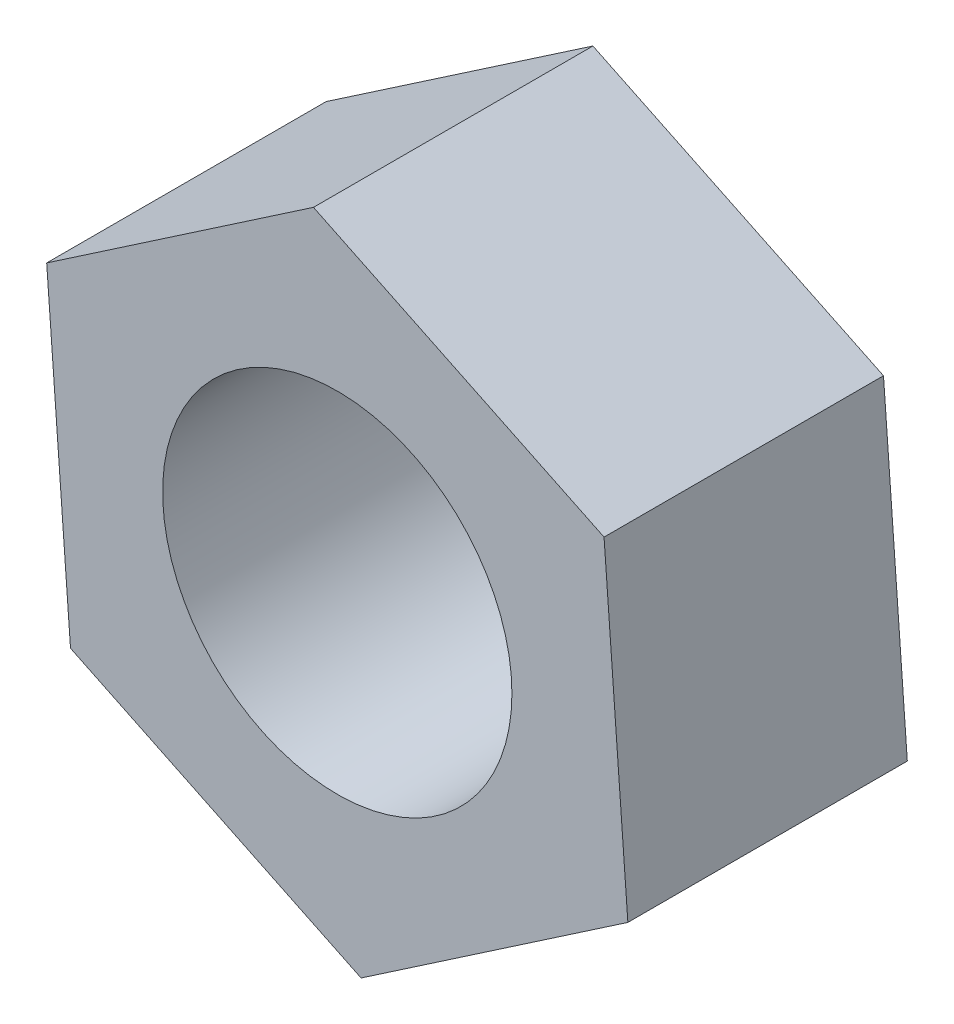
ISO-10303-21;
HEADER;
FILE_DESCRIPTION(('STEP AP214'),'2;1');
FILE_NAME('part.step','',(''),(''),'','','');
FILE_SCHEMA(('AUTOMOTIVE_DESIGN { 1 0 10303 214 1 1 1 1 }'));
ENDSEC;
DATA;
#1=APPLICATION_CONTEXT('core data for automotive mechanical design processes');
#2=APPLICATION_PROTOCOL_DEFINITION('international standard','automotive_design',2000,#1);
#3=PRODUCT_CONTEXT('',#1,'mechanical');
#4=PRODUCT('Part','Part','',(#3));
#5=PRODUCT_RELATED_PRODUCT_CATEGORY('part','',(#4));
#6=PRODUCT_DEFINITION_FORMATION('','',#4);
#7=PRODUCT_DEFINITION_CONTEXT('part definition',#1,'design');
#8=PRODUCT_DEFINITION('design','',#6,#7);
#9=PRODUCT_DEFINITION_SHAPE('','',#8);
#10=(LENGTH_UNIT() NAMED_UNIT(*) SI_UNIT(.MILLI.,.METRE.));
#11=(NAMED_UNIT(*) PLANE_ANGLE_UNIT() SI_UNIT($,.RADIAN.));
#12=(NAMED_UNIT(*) SI_UNIT($,.STERADIAN.) SOLID_ANGLE_UNIT());
#13=UNCERTAINTY_MEASURE_WITH_UNIT(LENGTH_MEASURE(1.E-05),#10,'distance_accuracy_value','');
#14=(GEOMETRIC_REPRESENTATION_CONTEXT(3) GLOBAL_UNCERTAINTY_ASSIGNED_CONTEXT((#13)) GLOBAL_UNIT_ASSIGNED_CONTEXT((#10,
#11,#12)) REPRESENTATION_CONTEXT('',''));
#15=CARTESIAN_POINT('',(0.,0.,0.));
#16=DIRECTION('',(0.,0.,1.));
#17=DIRECTION('',(1.,0.,0.));
#18=AXIS2_PLACEMENT_3D('',#15,#16,#17);
#19=CARTESIAN_POINT('',(0.,0.,4.));
#20=DIRECTION('',(0.,0.,1.));
#21=DIRECTION('',(1.,0.,0.));
#22=AXIS2_PLACEMENT_3D('',#19,#20,#21);
#23=PLANE('',#22);
#24=DIRECTION('',(0.0738190941873397,-0.997271648716317,0.));
#25=VECTOR('',#24,1.);
#26=CARTESIAN_POINT('',(-4.15956449046685,2.00782384261683,4.));
#27=LINE('',#26,#25);
#28=CARTESIAN_POINT('',(-4.15956449046685,2.00782384261683,4.));
#29=VERTEX_POINT('',#28);
#30=CARTESIAN_POINT('',(-3.81860869926369,-2.59837659611555,4.));
#31=VERTEX_POINT('',#30);
#32=EDGE_CURVE('E130',#29,#31,#27,.T.);
#33=ORIENTED_EDGE('',*,*,#32,.T.);
#34=DIRECTION('',(0.900572129355991,-0.434706613507566,0.));
#35=VECTOR('',#34,1.);
#36=CARTESIAN_POINT('',(-3.81860869926369,-2.59837659611555,4.));
#37=LINE('',#36,#35);
#38=CARTESIAN_POINT('',(0.340955791203159,-4.60620043873238,4.));
#39=VERTEX_POINT('',#38);
#40=EDGE_CURVE('E88',#31,#39,#37,.T.);
#41=ORIENTED_EDGE('',*,*,#40,.T.);
#42=DIRECTION('',(0.826753035168651,0.562565035208751,0.));
#43=VECTOR('',#42,1.);
#44=CARTESIAN_POINT('',(0.340955791203159,-4.60620043873238,4.));
#45=LINE('',#44,#43);
#46=CARTESIAN_POINT('',(4.15956449046685,-2.00782384261683,4.));
#47=VERTEX_POINT('',#46);
#48=EDGE_CURVE('E101',#39,#47,#45,.T.);
#49=ORIENTED_EDGE('',*,*,#48,.T.);
#50=DIRECTION('',(-0.07381909418734,0.997271648716317,0.));
#51=VECTOR('',#50,1.);
#52=CARTESIAN_POINT('',(4.15956449046685,-2.00782384261683,4.));
#53=LINE('',#52,#51);
#54=CARTESIAN_POINT('',(3.81860869926369,2.59837659611555,4.));
#55=VERTEX_POINT('',#54);
#56=EDGE_CURVE('E95',#47,#55,#53,.T.);
#57=ORIENTED_EDGE('',*,*,#56,.T.);
#58=DIRECTION('',(-0.900572129355991,0.434706613507566,0.));
#59=VECTOR('',#58,1.);
#60=CARTESIAN_POINT('',(3.81860869926369,2.59837659611555,4.));
#61=LINE('',#60,#59);
#62=CARTESIAN_POINT('',(-0.340955791203159,4.60620043873238,4.));
#63=VERTEX_POINT('',#62);
#64=EDGE_CURVE('E99',#55,#63,#61,.T.);
#65=ORIENTED_EDGE('',*,*,#64,.T.);
#66=DIRECTION('',(-0.826753035168651,-0.562565035208751,0.));
#67=VECTOR('',#66,1.);
#68=CARTESIAN_POINT('',(-0.340955791203159,4.60620043873238,4.));
#69=LINE('',#68,#67);
#70=EDGE_CURVE('E51',#63,#29,#69,.T.);
#71=ORIENTED_EDGE('',*,*,#70,.T.);
#72=EDGE_LOOP('',(#33,#41,#49,#57,#65,#71));
#73=FACE_BOUND('',#72,.T.);
#74=CARTESIAN_POINT('',(0.,0.,4.));
#75=DIRECTION('',(0.,0.,1.));
#76=DIRECTION('',(1.,0.,0.));
#77=AXIS2_PLACEMENT_3D('',#74,#75,#76);
#78=CIRCLE('',#77,2.5);
#79=CARTESIAN_POINT('',(2.5,0.,4.));
#80=VERTEX_POINT('',#79);
#81=EDGE_CURVE('E123',#80,#80,#78,.T.);
#82=ORIENTED_EDGE('',*,*,#81,.F.);
#83=EDGE_LOOP('',(#82));
#84=FACE_BOUND('',#83,.T.);
#85=ADVANCED_FACE('F34',(#73,#84),#23,.T.);
#86=CARTESIAN_POINT('',(0.,0.,0.));
#87=DIRECTION('',(0.,0.,1.));
#88=DIRECTION('',(1.,0.,0.));
#89=AXIS2_PLACEMENT_3D('',#86,#87,#88);
#90=PLANE('',#89);
#91=DIRECTION('',(0.0738190941873397,-0.997271648716317,0.));
#92=VECTOR('',#91,1.);
#93=CARTESIAN_POINT('',(-4.15956449046685,2.00782384261683,0.));
#94=LINE('',#93,#92);
#95=CARTESIAN_POINT('',(-4.15956449046685,2.00782384261683,0.));
#96=VERTEX_POINT('',#95);
#97=CARTESIAN_POINT('',(-3.81860869926369,-2.59837659611555,0.));
#98=VERTEX_POINT('',#97);
#99=EDGE_CURVE('E119',#96,#98,#94,.T.);
#100=ORIENTED_EDGE('',*,*,#99,.F.);
#101=DIRECTION('',(-0.826753035168651,-0.562565035208751,0.));
#102=VECTOR('',#101,1.);
#103=CARTESIAN_POINT('',(-0.340955791203159,4.60620043873238,0.));
#104=LINE('',#103,#102);
#105=CARTESIAN_POINT('',(-0.340955791203159,4.60620043873238,0.));
#106=VERTEX_POINT('',#105);
#107=EDGE_CURVE('E80',#106,#96,#104,.T.);
#108=ORIENTED_EDGE('',*,*,#107,.F.);
#109=DIRECTION('',(-0.900572129355991,0.434706613507566,0.));
#110=VECTOR('',#109,1.);
#111=CARTESIAN_POINT('',(3.81860869926369,2.59837659611555,0.));
#112=LINE('',#111,#110);
#113=CARTESIAN_POINT('',(3.81860869926369,2.59837659611555,0.));
#114=VERTEX_POINT('',#113);
#115=EDGE_CURVE('E74',#114,#106,#112,.T.);
#116=ORIENTED_EDGE('',*,*,#115,.F.);
#117=DIRECTION('',(-0.07381909418734,0.997271648716317,0.));
#118=VECTOR('',#117,1.);
#119=CARTESIAN_POINT('',(4.15956449046685,-2.00782384261683,0.));
#120=LINE('',#119,#118);
#121=CARTESIAN_POINT('',(4.15956449046685,-2.00782384261683,0.));
#122=VERTEX_POINT('',#121);
#123=EDGE_CURVE('E109',#122,#114,#120,.T.);
#124=ORIENTED_EDGE('',*,*,#123,.F.);
#125=DIRECTION('',(0.826753035168651,0.562565035208751,0.));
#126=VECTOR('',#125,1.);
#127=CARTESIAN_POINT('',(0.340955791203159,-4.60620043873238,0.));
#128=LINE('',#127,#126);
#129=CARTESIAN_POINT('',(0.340955791203159,-4.60620043873238,0.));
#130=VERTEX_POINT('',#129);
#131=EDGE_CURVE('E125',#130,#122,#128,.T.);
#132=ORIENTED_EDGE('',*,*,#131,.F.);
#133=DIRECTION('',(0.900572129355991,-0.434706613507566,0.));
#134=VECTOR('',#133,1.);
#135=CARTESIAN_POINT('',(-3.81860869926369,-2.59837659611555,0.));
#136=LINE('',#135,#134);
#137=EDGE_CURVE('E122',#98,#130,#136,.T.);
#138=ORIENTED_EDGE('',*,*,#137,.F.);
#139=EDGE_LOOP('',(#100,#108,#116,#124,#132,#138));
#140=FACE_BOUND('',#139,.T.);
#141=CARTESIAN_POINT('',(0.,0.,0.));
#142=DIRECTION('',(0.,0.,1.));
#143=DIRECTION('',(1.,0.,0.));
#144=AXIS2_PLACEMENT_3D('',#141,#142,#143);
#145=CIRCLE('',#144,2.5);
#146=CARTESIAN_POINT('',(2.5,0.,0.));
#147=VERTEX_POINT('',#146);
#148=EDGE_CURVE('E223',#147,#147,#145,.T.);
#149=ORIENTED_EDGE('',*,*,#148,.T.);
#150=EDGE_LOOP('',(#149));
#151=FACE_BOUND('',#150,.T.);
#152=ADVANCED_FACE('F139',(#140,#151),#90,.F.);
#153=CARTESIAN_POINT('',(-4.15956449046685,2.00782384261683,4.));
#154=DIRECTION('',(0.997271648716317,0.0738190941873397,0.));
#155=DIRECTION('',(-0.0738190941873397,0.997271648716317,0.));
#156=AXIS2_PLACEMENT_3D('',#153,#154,#155);
#157=PLANE('',#156);
#158=ORIENTED_EDGE('',*,*,#99,.T.);
#159=DIRECTION('',(0.,0.,-1.));
#160=VECTOR('',#159,1.);
#161=CARTESIAN_POINT('',(-3.81860869926369,-2.59837659611555,4.));
#162=LINE('',#161,#160);
#163=EDGE_CURVE('E11',#31,#98,#162,.T.);
#164=ORIENTED_EDGE('',*,*,#163,.F.);
#165=ORIENTED_EDGE('',*,*,#32,.F.);
#166=DIRECTION('',(0.,0.,-1.));
#167=VECTOR('',#166,1.);
#168=CARTESIAN_POINT('',(-4.15956449046685,2.00782384261683,4.));
#169=LINE('',#168,#167);
#170=EDGE_CURVE('E115',#29,#96,#169,.T.);
#171=ORIENTED_EDGE('',*,*,#170,.T.);
#172=EDGE_LOOP('',(#158,#164,#165,#171));
#173=FACE_BOUND('',#172,.T.);
#174=ADVANCED_FACE('F36',(#173),#157,.F.);
#175=CARTESIAN_POINT('',(-3.81860869926369,-2.59837659611555,4.));
#176=DIRECTION('',(0.434706613507566,0.900572129355991,0.));
#177=DIRECTION('',(-0.900572129355991,0.434706613507566,0.));
#178=AXIS2_PLACEMENT_3D('',#175,#176,#177);
#179=PLANE('',#178);
#180=ORIENTED_EDGE('',*,*,#137,.T.);
#181=DIRECTION('',(0.,0.,-1.));
#182=VECTOR('',#181,1.);
#183=CARTESIAN_POINT('',(0.340955791203159,-4.60620043873238,4.));
#184=LINE('',#183,#182);
#185=EDGE_CURVE('E43',#39,#130,#184,.T.);
#186=ORIENTED_EDGE('',*,*,#185,.F.);
#187=ORIENTED_EDGE('',*,*,#40,.F.);
#188=ORIENTED_EDGE('',*,*,#163,.T.);
#189=EDGE_LOOP('',(#180,#186,#187,#188));
#190=FACE_BOUND('',#189,.T.);
#191=ADVANCED_FACE('F164',(#190),#179,.F.);
#192=CARTESIAN_POINT('',(0.340955791203159,-4.60620043873238,4.));
#193=DIRECTION('',(-0.562565035208751,0.826753035168651,0.));
#194=DIRECTION('',(-0.826753035168651,-0.562565035208751,0.));
#195=AXIS2_PLACEMENT_3D('',#192,#193,#194);
#196=PLANE('',#195);
#197=ORIENTED_EDGE('',*,*,#131,.T.);
#198=DIRECTION('',(0.,0.,-1.));
#199=VECTOR('',#198,1.);
#200=CARTESIAN_POINT('',(4.15956449046685,-2.00782384261683,4.));
#201=LINE('',#200,#199);
#202=EDGE_CURVE('E110',#47,#122,#201,.T.);
#203=ORIENTED_EDGE('',*,*,#202,.F.);
#204=ORIENTED_EDGE('',*,*,#48,.F.);
#205=ORIENTED_EDGE('',*,*,#185,.T.);
#206=EDGE_LOOP('',(#197,#203,#204,#205));
#207=FACE_BOUND('',#206,.T.);
#208=ADVANCED_FACE('F136',(#207),#196,.F.);
#209=CARTESIAN_POINT('',(4.15956449046685,-2.00782384261683,4.));
#210=DIRECTION('',(-0.997271648716317,-0.07381909418734,0.));
#211=DIRECTION('',(0.07381909418734,-0.997271648716317,0.));
#212=AXIS2_PLACEMENT_3D('',#209,#210,#211);
#213=PLANE('',#212);
#214=ORIENTED_EDGE('',*,*,#123,.T.);
#215=DIRECTION('',(0.,0.,-1.));
#216=VECTOR('',#215,1.);
#217=CARTESIAN_POINT('',(3.81860869926369,2.59837659611555,4.));
#218=LINE('',#217,#216);
#219=EDGE_CURVE('E106',#55,#114,#218,.T.);
#220=ORIENTED_EDGE('',*,*,#219,.F.);
#221=ORIENTED_EDGE('',*,*,#56,.F.);
#222=ORIENTED_EDGE('',*,*,#202,.T.);
#223=EDGE_LOOP('',(#214,#220,#221,#222));
#224=FACE_BOUND('',#223,.T.);
#225=ADVANCED_FACE('F107',(#224),#213,.F.);
#226=CARTESIAN_POINT('',(3.81860869926369,2.59837659611555,4.));
#227=DIRECTION('',(-0.434706613507566,-0.900572129355991,0.));
#228=DIRECTION('',(0.900572129355991,-0.434706613507566,0.));
#229=AXIS2_PLACEMENT_3D('',#226,#227,#228);
#230=PLANE('',#229);
#231=ORIENTED_EDGE('',*,*,#115,.T.);
#232=DIRECTION('',(0.,0.,-1.));
#233=VECTOR('',#232,1.);
#234=CARTESIAN_POINT('',(-0.340955791203159,4.60620043873238,4.));
#235=LINE('',#234,#233);
#236=EDGE_CURVE('E111',#63,#106,#235,.T.);
#237=ORIENTED_EDGE('',*,*,#236,.F.);
#238=ORIENTED_EDGE('',*,*,#64,.F.);
#239=ORIENTED_EDGE('',*,*,#219,.T.);
#240=EDGE_LOOP('',(#231,#237,#238,#239));
#241=FACE_BOUND('',#240,.T.);
#242=ADVANCED_FACE('F113',(#241),#230,.F.);
#243=CARTESIAN_POINT('',(-0.340955791203159,4.60620043873238,4.));
#244=DIRECTION('',(0.562565035208751,-0.826753035168651,0.));
#245=DIRECTION('',(0.826753035168651,0.562565035208751,0.));
#246=AXIS2_PLACEMENT_3D('',#243,#244,#245);
#247=PLANE('',#246);
#248=ORIENTED_EDGE('',*,*,#107,.T.);
#249=ORIENTED_EDGE('',*,*,#170,.F.);
#250=ORIENTED_EDGE('',*,*,#70,.F.);
#251=ORIENTED_EDGE('',*,*,#236,.T.);
#252=EDGE_LOOP('',(#248,#249,#250,#251));
#253=FACE_BOUND('',#252,.T.);
#254=ADVANCED_FACE('F144',(#253),#247,.F.);
#255=CARTESIAN_POINT('',(0.,0.,4.));
#256=DIRECTION('',(0.,0.,-1.));
#257=DIRECTION('',(-1.,0.,0.));
#258=AXIS2_PLACEMENT_3D('',#255,#256,#257);
#259=CYLINDRICAL_SURFACE('',#258,2.5);
#260=ORIENTED_EDGE('',*,*,#81,.T.);
#261=EDGE_LOOP('',(#260));
#262=FACE_BOUND('',#261,.T.);
#263=ORIENTED_EDGE('',*,*,#148,.F.);
#264=EDGE_LOOP('',(#263));
#265=FACE_BOUND('',#264,.T.);
#266=ADVANCED_FACE('F146',(#262,#265),#259,.F.);
#267=CLOSED_SHELL('',(#85,#152,#174,#191,#208,#225,#242,#254,#266));
#268=MANIFOLD_SOLID_BREP('B2',#267);
#269=ADVANCED_BREP_SHAPE_REPRESENTATION('',(#18,#268),#14);
#270=SHAPE_DEFINITION_REPRESENTATION(#9,#269);
ENDSEC;
END-ISO-10303-21;
